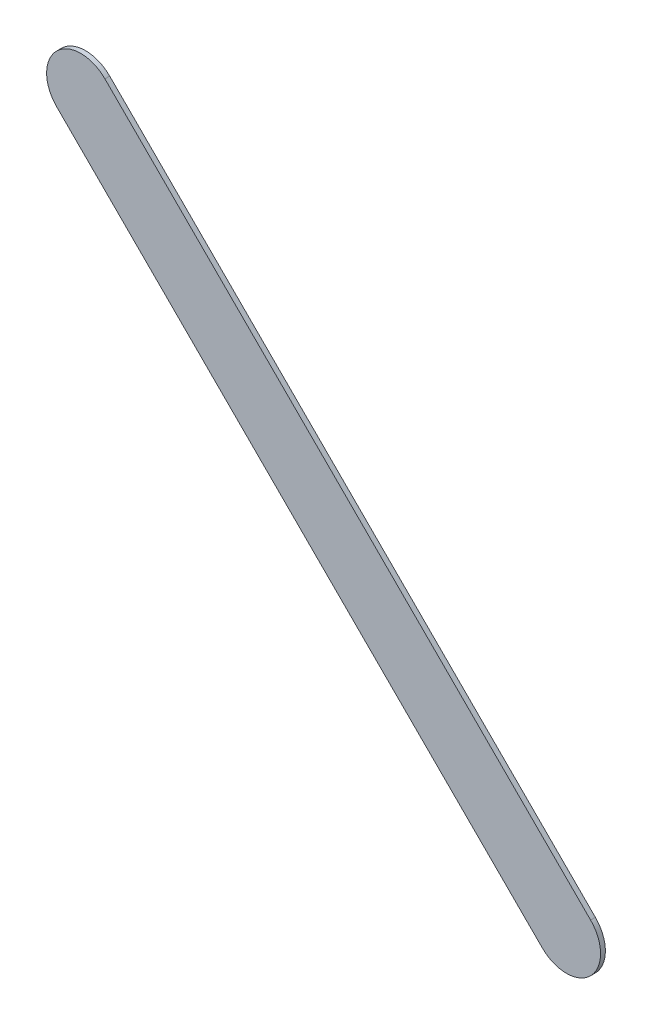
ISO-10303-21;
HEADER;
FILE_DESCRIPTION(('STEP AP214'),'2;1');
FILE_NAME('part.step','',(''),(''),'','','');
FILE_SCHEMA(('AUTOMOTIVE_DESIGN { 1 0 10303 214 1 1 1 1 }'));
ENDSEC;
DATA;
#1=APPLICATION_CONTEXT('core data for automotive mechanical design processes');
#2=APPLICATION_PROTOCOL_DEFINITION('international standard','automotive_design',2000,#1);
#3=PRODUCT_CONTEXT('',#1,'mechanical');
#4=PRODUCT('Part','Part','',(#3));
#5=PRODUCT_RELATED_PRODUCT_CATEGORY('part','',(#4));
#6=PRODUCT_DEFINITION_FORMATION('','',#4);
#7=PRODUCT_DEFINITION_CONTEXT('part definition',#1,'design');
#8=PRODUCT_DEFINITION('design','',#6,#7);
#9=PRODUCT_DEFINITION_SHAPE('','',#8);
#10=(LENGTH_UNIT() NAMED_UNIT(*) SI_UNIT(.MILLI.,.METRE.));
#11=(NAMED_UNIT(*) PLANE_ANGLE_UNIT() SI_UNIT($,.RADIAN.));
#12=(NAMED_UNIT(*) SI_UNIT($,.STERADIAN.) SOLID_ANGLE_UNIT());
#13=UNCERTAINTY_MEASURE_WITH_UNIT(LENGTH_MEASURE(1.E-05),#10,'distance_accuracy_value','');
#14=(GEOMETRIC_REPRESENTATION_CONTEXT(3) GLOBAL_UNCERTAINTY_ASSIGNED_CONTEXT((#13)) GLOBAL_UNIT_ASSIGNED_CONTEXT((#10,
#11,#12)) REPRESENTATION_CONTEXT('',''));
#15=CARTESIAN_POINT('',(0.,0.,0.));
#16=DIRECTION('',(0.,0.,1.));
#17=DIRECTION('',(1.,0.,0.));
#18=AXIS2_PLACEMENT_3D('',#15,#16,#17);
#19=CARTESIAN_POINT('',(168.225223,-147.750776,0.));
#20=DIRECTION('',(0.,0.,1.));
#21=DIRECTION('',(1.,0.,0.));
#22=AXIS2_PLACEMENT_3D('',#19,#20,#21);
#23=PLANE('',#22);
#24=DIRECTION('',(0.707106781186548,-0.707106781186548,0.));
#25=VECTOR('',#24,1.);
#26=CARTESIAN_POINT('',(168.225223,-147.750776,0.));
#27=LINE('',#26,#25);
#28=CARTESIAN_POINT('',(168.225223,-147.750776,0.));
#29=VERTEX_POINT('',#28);
#30=CARTESIAN_POINT('',(171.781223,-151.306776,0.));
#31=VERTEX_POINT('',#30);
#32=EDGE_CURVE('E98',#29,#31,#27,.T.);
#33=ORIENTED_EDGE('',*,*,#32,.T.);
#34=CARTESIAN_POINT('',(171.9579995,-151.1299995,0.));
#35=DIRECTION('',(0.,0.,1.));
#36=DIRECTION('',(-0.707106781186048,-0.707106781187048,0.));
#37=AXIS2_PLACEMENT_3D('',#34,#35,#36);
#38=CIRCLE('',#37,0.249999723809);
#39=CARTESIAN_POINT('',(172.134776,-150.953223,0.));
#40=VERTEX_POINT('',#39);
#41=EDGE_CURVE('E77',#31,#40,#38,.T.);
#42=ORIENTED_EDGE('',*,*,#41,.T.);
#43=DIRECTION('',(-0.707106781186548,0.707106781186548,0.));
#44=VECTOR('',#43,1.);
#45=CARTESIAN_POINT('',(172.134776,-150.953223,0.));
#46=LINE('',#45,#44);
#47=CARTESIAN_POINT('',(168.578776,-147.397223,0.));
#48=VERTEX_POINT('',#47);
#49=EDGE_CURVE('E82',#40,#48,#46,.T.);
#50=ORIENTED_EDGE('',*,*,#49,.T.);
#51=CARTESIAN_POINT('',(168.4019995,-147.5739995,0.));
#52=DIRECTION('',(0.,0.,1.));
#53=DIRECTION('',(0.707106781186548,0.707106781186548,0.));
#54=AXIS2_PLACEMENT_3D('',#51,#52,#53);
#55=CIRCLE('',#54,0.249999723809);
#56=EDGE_CURVE('E11',#48,#29,#55,.T.);
#57=ORIENTED_EDGE('',*,*,#56,.T.);
#58=EDGE_LOOP('',(#33,#42,#50,#57));
#59=FACE_BOUND('',#58,.T.);
#60=ADVANCED_FACE('F17',(#59),#23,.T.);
#61=CARTESIAN_POINT('',(168.225223,-147.750776,-0.035));
#62=DIRECTION('',(0.,0.,1.));
#63=DIRECTION('',(1.,0.,0.));
#64=AXIS2_PLACEMENT_3D('',#61,#62,#63);
#65=PLANE('',#64);
#66=CARTESIAN_POINT('',(168.4019995,-147.5739995,-0.035));
#67=DIRECTION('',(0.,0.,1.));
#68=DIRECTION('',(0.707106781186548,0.707106781186548,0.));
#69=AXIS2_PLACEMENT_3D('',#66,#67,#68);
#70=CIRCLE('',#69,0.249999723809);
#71=CARTESIAN_POINT('',(168.578776,-147.397223,-0.035));
#72=VERTEX_POINT('',#71);
#73=CARTESIAN_POINT('',(168.225223,-147.750776,-0.035));
#74=VERTEX_POINT('',#73);
#75=EDGE_CURVE('E20',#72,#74,#70,.T.);
#76=ORIENTED_EDGE('',*,*,#75,.F.);
#77=DIRECTION('',(-0.707106781186548,0.707106781186548,0.));
#78=VECTOR('',#77,1.);
#79=CARTESIAN_POINT('',(172.134776,-150.953223,-0.035));
#80=LINE('',#79,#78);
#81=CARTESIAN_POINT('',(172.134776,-150.953223,-0.035));
#82=VERTEX_POINT('',#81);
#83=EDGE_CURVE('E67',#82,#72,#80,.T.);
#84=ORIENTED_EDGE('',*,*,#83,.F.);
#85=CARTESIAN_POINT('',(171.9579995,-151.1299995,-0.035));
#86=DIRECTION('',(0.,0.,1.));
#87=DIRECTION('',(-0.707106781186048,-0.707106781187048,0.));
#88=AXIS2_PLACEMENT_3D('',#85,#86,#87);
#89=CIRCLE('',#88,0.249999723809);
#90=CARTESIAN_POINT('',(171.781223,-151.306776,-0.035));
#91=VERTEX_POINT('',#90);
#92=EDGE_CURVE('E71',#91,#82,#89,.T.);
#93=ORIENTED_EDGE('',*,*,#92,.F.);
#94=DIRECTION('',(0.707106781186548,-0.707106781186548,0.));
#95=VECTOR('',#94,1.);
#96=CARTESIAN_POINT('',(168.225223,-147.750776,-0.035));
#97=LINE('',#96,#95);
#98=EDGE_CURVE('E118',#74,#91,#97,.T.);
#99=ORIENTED_EDGE('',*,*,#98,.F.);
#100=EDGE_LOOP('',(#76,#84,#93,#99));
#101=FACE_BOUND('',#100,.T.);
#102=ADVANCED_FACE('F69',(#101),#65,.F.);
#103=CARTESIAN_POINT('',(168.4019995,-147.5739995,-0.035));
#104=DIRECTION('',(0.,0.,-1.));
#105=DIRECTION('',(0.707106781186548,0.707106781186548,0.));
#106=AXIS2_PLACEMENT_3D('',#103,#104,#105);
#107=CYLINDRICAL_SURFACE('',#106,0.249999723809);
#108=ORIENTED_EDGE('',*,*,#75,.T.);
#109=DIRECTION('',(0.,0.,1.));
#110=VECTOR('',#109,1.);
#111=CARTESIAN_POINT('',(168.225223,-147.750776,-0.035));
#112=LINE('',#111,#110);
#113=EDGE_CURVE('E92',#74,#29,#112,.T.);
#114=ORIENTED_EDGE('',*,*,#113,.T.);
#115=ORIENTED_EDGE('',*,*,#56,.F.);
#116=DIRECTION('',(0.,0.,1.));
#117=VECTOR('',#116,1.);
#118=CARTESIAN_POINT('',(168.578776,-147.397223,-0.035));
#119=LINE('',#118,#117);
#120=EDGE_CURVE('E76',#72,#48,#119,.T.);
#121=ORIENTED_EDGE('',*,*,#120,.F.);
#122=EDGE_LOOP('',(#108,#114,#115,#121));
#123=FACE_BOUND('',#122,.T.);
#124=ADVANCED_FACE('F130',(#123),#107,.T.);
#125=CARTESIAN_POINT('',(172.134776,-150.953223,-0.035));
#126=DIRECTION('',(-0.707106781186548,-0.707106781186548,0.));
#127=DIRECTION('',(-0.707106781186548,0.707106781186548,0.));
#128=AXIS2_PLACEMENT_3D('',#125,#126,#127);
#129=PLANE('',#128);
#130=ORIENTED_EDGE('',*,*,#83,.T.);
#131=ORIENTED_EDGE('',*,*,#120,.T.);
#132=ORIENTED_EDGE('',*,*,#49,.F.);
#133=DIRECTION('',(0.,0.,1.));
#134=VECTOR('',#133,1.);
#135=CARTESIAN_POINT('',(172.134776,-150.953223,-0.035));
#136=LINE('',#135,#134);
#137=EDGE_CURVE('E80',#82,#40,#136,.T.);
#138=ORIENTED_EDGE('',*,*,#137,.F.);
#139=EDGE_LOOP('',(#130,#131,#132,#138));
#140=FACE_BOUND('',#139,.T.);
#141=ADVANCED_FACE('F81',(#140),#129,.F.);
#142=CARTESIAN_POINT('',(171.9579995,-151.1299995,-0.035));
#143=DIRECTION('',(0.,0.,-1.));
#144=DIRECTION('',(-0.707106781186048,-0.707106781187048,0.));
#145=AXIS2_PLACEMENT_3D('',#142,#143,#144);
#146=CYLINDRICAL_SURFACE('',#145,0.249999723809);
#147=ORIENTED_EDGE('',*,*,#92,.T.);
#148=ORIENTED_EDGE('',*,*,#137,.T.);
#149=ORIENTED_EDGE('',*,*,#41,.F.);
#150=DIRECTION('',(0.,0.,1.));
#151=VECTOR('',#150,1.);
#152=CARTESIAN_POINT('',(171.781223,-151.306776,-0.035));
#153=LINE('',#152,#151);
#154=EDGE_CURVE('E89',#91,#31,#153,.T.);
#155=ORIENTED_EDGE('',*,*,#154,.F.);
#156=EDGE_LOOP('',(#147,#148,#149,#155));
#157=FACE_BOUND('',#156,.T.);
#158=ADVANCED_FACE('F87',(#157),#146,.T.);
#159=CARTESIAN_POINT('',(168.225223,-147.750776,-0.035));
#160=DIRECTION('',(0.707106781186548,0.707106781186548,0.));
#161=DIRECTION('',(0.,0.,-1.));
#162=AXIS2_PLACEMENT_3D('',#159,#160,#161);
#163=PLANE('',#162);
#164=ORIENTED_EDGE('',*,*,#98,.T.);
#165=ORIENTED_EDGE('',*,*,#154,.T.);
#166=ORIENTED_EDGE('',*,*,#32,.F.);
#167=ORIENTED_EDGE('',*,*,#113,.F.);
#168=EDGE_LOOP('',(#164,#165,#166,#167));
#169=FACE_BOUND('',#168,.T.);
#170=ADVANCED_FACE('F127',(#169),#163,.F.);
#171=CLOSED_SHELL('',(#60,#102,#124,#141,#158,#170));
#172=MANIFOLD_SOLID_BREP('B1',#171);
#173=ADVANCED_BREP_SHAPE_REPRESENTATION('',(#18,#172),#14);
#174=SHAPE_DEFINITION_REPRESENTATION(#9,#173);
ENDSEC;
END-ISO-10303-21;
